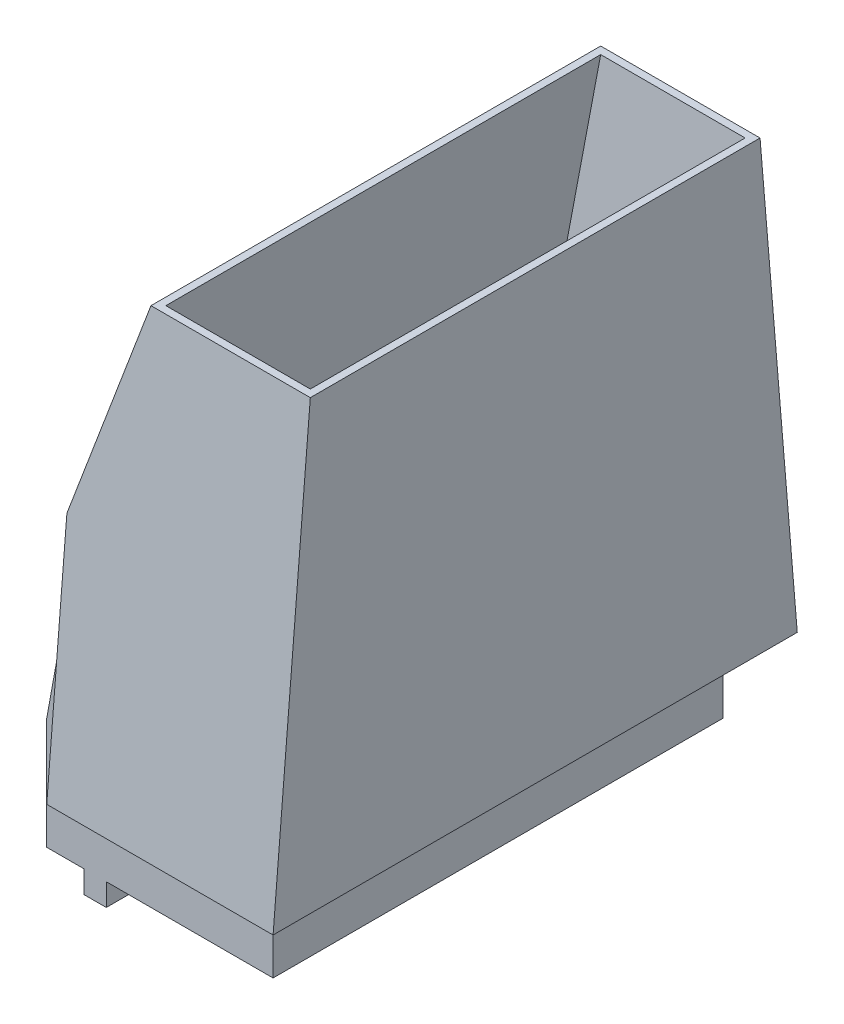
ISO-10303-21;
HEADER;
FILE_DESCRIPTION(('STEP AP214'),'2;1');
FILE_NAME('part.step','',(''),(''),'','','');
FILE_SCHEMA(('AUTOMOTIVE_DESIGN { 1 0 10303 214 1 1 1 1 }'));
ENDSEC;
DATA;
#1=APPLICATION_CONTEXT('core data for automotive mechanical design processes');
#2=APPLICATION_PROTOCOL_DEFINITION('international standard','automotive_design',2000,#1);
#3=PRODUCT_CONTEXT('',#1,'mechanical');
#4=PRODUCT('Part','Part','',(#3));
#5=PRODUCT_RELATED_PRODUCT_CATEGORY('part','',(#4));
#6=PRODUCT_DEFINITION_FORMATION('','',#4);
#7=PRODUCT_DEFINITION_CONTEXT('part definition',#1,'design');
#8=PRODUCT_DEFINITION('design','',#6,#7);
#9=PRODUCT_DEFINITION_SHAPE('','',#8);
#10=(LENGTH_UNIT() NAMED_UNIT(*) SI_UNIT(.MILLI.,.METRE.));
#11=(NAMED_UNIT(*) PLANE_ANGLE_UNIT() SI_UNIT($,.RADIAN.));
#12=(NAMED_UNIT(*) SI_UNIT($,.STERADIAN.) SOLID_ANGLE_UNIT());
#13=UNCERTAINTY_MEASURE_WITH_UNIT(LENGTH_MEASURE(1.E-05),#10,'distance_accuracy_value','');
#14=(GEOMETRIC_REPRESENTATION_CONTEXT(3) GLOBAL_UNCERTAINTY_ASSIGNED_CONTEXT((#13)) GLOBAL_UNIT_ASSIGNED_CONTEXT((#10,
#11,#12)) REPRESENTATION_CONTEXT('',''));
#15=CARTESIAN_POINT('',(0.,0.,0.));
#16=DIRECTION('',(0.,0.,1.));
#17=DIRECTION('',(1.,0.,0.));
#18=AXIS2_PLACEMENT_3D('',#15,#16,#17);
#19=CARTESIAN_POINT('',(19.,14.875,60.4));
#20=DIRECTION('',(0.,1.,0.));
#21=DIRECTION('',(0.,0.,1.));
#22=AXIS2_PLACEMENT_3D('',#19,#20,#21);
#23=PLANE('',#22);
#24=DIRECTION('',(1.,0.,0.));
#25=VECTOR('',#24,1.);
#26=CARTESIAN_POINT('',(19.,14.875,0.));
#27=LINE('',#26,#25);
#28=CARTESIAN_POINT('',(-3.4,14.875,0.));
#29=VERTEX_POINT('',#28);
#30=CARTESIAN_POINT('',(19.,14.875,0.));
#31=VERTEX_POINT('',#30);
#32=EDGE_CURVE('E212',#29,#31,#27,.T.);
#33=ORIENTED_EDGE('',*,*,#32,.T.);
#34=DIRECTION('',(0.,0.,-1.));
#35=VECTOR('',#34,1.);
#36=CARTESIAN_POINT('',(19.,14.875,60.4));
#37=LINE('',#36,#35);
#38=CARTESIAN_POINT('',(19.,14.875,60.4));
#39=VERTEX_POINT('',#38);
#40=EDGE_CURVE('E226',#39,#31,#37,.T.);
#41=ORIENTED_EDGE('',*,*,#40,.F.);
#42=DIRECTION('',(1.,0.,0.));
#43=VECTOR('',#42,1.);
#44=CARTESIAN_POINT('',(19.,14.875,60.4));
#45=LINE('',#44,#43);
#46=CARTESIAN_POINT('',(-3.4,14.875,60.4));
#47=VERTEX_POINT('',#46);
#48=EDGE_CURVE('E204',#47,#39,#45,.T.);
#49=ORIENTED_EDGE('',*,*,#48,.F.);
#50=DIRECTION('',(0.,0.,-1.));
#51=VECTOR('',#50,1.);
#52=CARTESIAN_POINT('',(-3.4,14.875,60.4));
#53=LINE('',#52,#51);
#54=CARTESIAN_POINT('',(-3.4,14.875,55.2));
#55=VERTEX_POINT('',#54);
#56=EDGE_CURVE('E313',#47,#55,#53,.T.);
#57=ORIENTED_EDGE('',*,*,#56,.T.);
#58=DIRECTION('',(1.,0.,0.));
#59=VECTOR('',#58,1.);
#60=CARTESIAN_POINT('',(-6.4,14.875,55.2));
#61=LINE('',#60,#59);
#62=CARTESIAN_POINT('',(14.,14.875,55.2));
#63=VERTEX_POINT('',#62);
#64=EDGE_CURVE('E54',#55,#63,#61,.T.);
#65=ORIENTED_EDGE('',*,*,#64,.T.);
#66=DIRECTION('',(0.,0.,-1.));
#67=VECTOR('',#66,1.);
#68=CARTESIAN_POINT('',(14.,14.875,60.4));
#69=LINE('',#68,#67);
#70=CARTESIAN_POINT('',(14.,14.875,5.2));
#71=VERTEX_POINT('',#70);
#72=EDGE_CURVE('E203',#63,#71,#69,.T.);
#73=ORIENTED_EDGE('',*,*,#72,.T.);
#74=DIRECTION('',(1.,0.,0.));
#75=VECTOR('',#74,1.);
#76=CARTESIAN_POINT('',(-6.4,14.875,5.2));
#77=LINE('',#76,#75);
#78=CARTESIAN_POINT('',(-3.4,14.875,5.2));
#79=VERTEX_POINT('',#78);
#80=EDGE_CURVE('E215',#79,#71,#77,.T.);
#81=ORIENTED_EDGE('',*,*,#80,.F.);
#82=EDGE_CURVE('E309',#79,#29,#53,.T.);
#83=ORIENTED_EDGE('',*,*,#82,.T.);
#84=EDGE_LOOP('',(#33,#41,#49,#57,#65,#73,#81,#83));
#85=FACE_BOUND('',#84,.T.);
#86=ADVANCED_FACE('F32',(#85),#23,.F.);
#87=CARTESIAN_POINT('',(19.,24.875,60.4));
#88=DIRECTION('',(-1.,0.,0.));
#89=DIRECTION('',(0.,-1.,0.));
#90=AXIS2_PLACEMENT_3D('',#87,#88,#89);
#91=PLANE('',#90);
#92=DIRECTION('',(0.,0.,-1.));
#93=VECTOR('',#92,1.);
#94=CARTESIAN_POINT('',(19.,24.875,60.4));
#95=LINE('',#94,#93);
#96=CARTESIAN_POINT('',(19.,24.875,60.4));
#97=VERTEX_POINT('',#96);
#98=CARTESIAN_POINT('',(19.,24.875,0.));
#99=VERTEX_POINT('',#98);
#100=EDGE_CURVE('E224',#97,#99,#95,.T.);
#101=ORIENTED_EDGE('',*,*,#100,.F.);
#102=DIRECTION('',(0.,-1.,0.));
#103=VECTOR('',#102,1.);
#104=CARTESIAN_POINT('',(19.,14.875,60.4));
#105=LINE('',#104,#103);
#106=EDGE_CURVE('E426',#97,#39,#105,.T.);
#107=ORIENTED_EDGE('',*,*,#106,.T.);
#108=ORIENTED_EDGE('',*,*,#40,.T.);
#109=DIRECTION('',(0.,1.,0.));
#110=VECTOR('',#109,1.);
#111=CARTESIAN_POINT('',(19.,0.,0.));
#112=LINE('',#111,#110);
#113=EDGE_CURVE('E340',#31,#99,#112,.T.);
#114=ORIENTED_EDGE('',*,*,#113,.T.);
#115=EDGE_LOOP('',(#101,#107,#108,#114));
#116=FACE_BOUND('',#115,.T.);
#117=ADVANCED_FACE('F417',(#116),#91,.F.);
#118=CARTESIAN_POINT('',(19.,24.875,60.4));
#119=DIRECTION('',(0.,1.,0.));
#120=DIRECTION('',(0.,0.,1.));
#121=AXIS2_PLACEMENT_3D('',#118,#119,#120);
#122=PLANE('',#121);
#123=DIRECTION('',(0.,0.,-1.));
#124=VECTOR('',#123,1.);
#125=CARTESIAN_POINT('',(24.,24.875,-5.));
#126=LINE('',#125,#124);
#127=CARTESIAN_POINT('',(24.,24.875,65.4));
#128=VERTEX_POINT('',#127);
#129=CARTESIAN_POINT('',(24.,24.875,-5.));
#130=VERTEX_POINT('',#129);
#131=EDGE_CURVE('E270',#128,#130,#126,.T.);
#132=ORIENTED_EDGE('',*,*,#131,.F.);
#133=DIRECTION('',(1.,0.,0.));
#134=VECTOR('',#133,1.);
#135=CARTESIAN_POINT('',(-6.4,24.875,65.4));
#136=LINE('',#135,#134);
#137=CARTESIAN_POINT('',(-6.4,24.875,65.4));
#138=VERTEX_POINT('',#137);
#139=EDGE_CURVE('E275',#138,#128,#136,.T.);
#140=ORIENTED_EDGE('',*,*,#139,.F.);
#141=DIRECTION('',(0.,0.,-1.));
#142=VECTOR('',#141,1.);
#143=CARTESIAN_POINT('',(-6.4,24.875,60.4));
#144=LINE('',#143,#142);
#145=CARTESIAN_POINT('',(-6.4,24.875,60.4));
#146=VERTEX_POINT('',#145);
#147=EDGE_CURVE('E282',#138,#146,#144,.T.);
#148=ORIENTED_EDGE('',*,*,#147,.T.);
#149=DIRECTION('',(-1.,0.,0.));
#150=VECTOR('',#149,1.);
#151=CARTESIAN_POINT('',(0.,24.875,60.4));
#152=LINE('',#151,#150);
#153=EDGE_CURVE('E236',#97,#146,#152,.T.);
#154=ORIENTED_EDGE('',*,*,#153,.F.);
#155=ORIENTED_EDGE('',*,*,#100,.T.);
#156=DIRECTION('',(-1.,0.,0.));
#157=VECTOR('',#156,1.);
#158=CARTESIAN_POINT('',(0.,24.875,0.));
#159=LINE('',#158,#157);
#160=CARTESIAN_POINT('',(-6.4,24.875,0.));
#161=VERTEX_POINT('',#160);
#162=EDGE_CURVE('E228',#99,#161,#159,.T.);
#163=ORIENTED_EDGE('',*,*,#162,.T.);
#164=DIRECTION('',(0.,0.,-1.));
#165=VECTOR('',#164,1.);
#166=CARTESIAN_POINT('',(-6.4,24.875,-5.));
#167=LINE('',#166,#165);
#168=CARTESIAN_POINT('',(-6.4,24.875,-5.));
#169=VERTEX_POINT('',#168);
#170=EDGE_CURVE('E283',#161,#169,#167,.T.);
#171=ORIENTED_EDGE('',*,*,#170,.T.);
#172=DIRECTION('',(1.,0.,0.));
#173=VECTOR('',#172,1.);
#174=CARTESIAN_POINT('',(-6.4,24.875,-5.));
#175=LINE('',#174,#173);
#176=EDGE_CURVE('E288',#169,#130,#175,.T.);
#177=ORIENTED_EDGE('',*,*,#176,.T.);
#178=EDGE_LOOP('',(#132,#140,#148,#154,#155,#163,#171,#177));
#179=FACE_BOUND('',#178,.T.);
#180=ADVANCED_FACE('F298',(#179),#122,.F.);
#181=CARTESIAN_POINT('',(24.,84.875,60.4));
#182=DIRECTION('',(-1.,0.,0.));
#183=DIRECTION('',(0.,-1.,0.));
#184=AXIS2_PLACEMENT_3D('',#181,#182,#183);
#185=PLANE('',#184);
#186=DIRECTION('',(0.,-0.99654575824488,0.0830454798537401));
#187=VECTOR('',#186,1.);
#188=CARTESIAN_POINT('',(24.,84.875,60.4));
#189=LINE('',#188,#187);
#190=CARTESIAN_POINT('',(24.,84.875,60.4));
#191=VERTEX_POINT('',#190);
#192=EDGE_CURVE('E202',#191,#128,#189,.T.);
#193=ORIENTED_EDGE('',*,*,#192,.T.);
#194=ORIENTED_EDGE('',*,*,#131,.T.);
#195=DIRECTION('',(0.,0.99654575824488,0.08304547985374));
#196=VECTOR('',#195,1.);
#197=CARTESIAN_POINT('',(24.,84.875,0.));
#198=LINE('',#197,#196);
#199=CARTESIAN_POINT('',(24.,84.875,0.));
#200=VERTEX_POINT('',#199);
#201=EDGE_CURVE('E273',#130,#200,#198,.T.);
#202=ORIENTED_EDGE('',*,*,#201,.T.);
#203=DIRECTION('',(0.,0.,-1.));
#204=VECTOR('',#203,1.);
#205=CARTESIAN_POINT('',(24.,84.875,60.4));
#206=LINE('',#205,#204);
#207=EDGE_CURVE('E222',#191,#200,#206,.T.);
#208=ORIENTED_EDGE('',*,*,#207,.F.);
#209=EDGE_LOOP('',(#193,#194,#202,#208));
#210=FACE_BOUND('',#209,.T.);
#211=ADVANCED_FACE('F305',(#210),#185,.F.);
#212=CARTESIAN_POINT('',(24.,84.875,60.4));
#213=DIRECTION('',(0.,-1.,0.));
#214=DIRECTION('',(0.,0.,-1.));
#215=AXIS2_PLACEMENT_3D('',#212,#213,#214);
#216=PLANE('',#215);
#217=DIRECTION('',(0.,0.,1.));
#218=VECTOR('',#217,1.);
#219=CARTESIAN_POINT('',(3.59999999999999,84.875,0.));
#220=LINE('',#219,#218);
#221=CARTESIAN_POINT('',(3.59999999999999,84.875,1.));
#222=VERTEX_POINT('',#221);
#223=CARTESIAN_POINT('',(3.59999999999999,84.875,59.4));
#224=VERTEX_POINT('',#223);
#225=EDGE_CURVE('E256',#222,#224,#220,.T.);
#226=ORIENTED_EDGE('',*,*,#225,.F.);
#227=DIRECTION('',(1.,0.,0.));
#228=VECTOR('',#227,1.);
#229=CARTESIAN_POINT('',(-6.40000000000001,84.875,1.));
#230=LINE('',#229,#228);
#231=CARTESIAN_POINT('',(23.,84.875,1.));
#232=VERTEX_POINT('',#231);
#233=EDGE_CURVE('E295',#222,#232,#230,.T.);
#234=ORIENTED_EDGE('',*,*,#233,.T.);
#235=DIRECTION('',(0.,0.,-1.));
#236=VECTOR('',#235,1.);
#237=CARTESIAN_POINT('',(23.,84.875,60.4));
#238=LINE('',#237,#236);
#239=CARTESIAN_POINT('',(23.,84.875,59.4));
#240=VERTEX_POINT('',#239);
#241=EDGE_CURVE('E219',#240,#232,#238,.T.);
#242=ORIENTED_EDGE('',*,*,#241,.F.);
#243=DIRECTION('',(1.,0.,0.));
#244=VECTOR('',#243,1.);
#245=CARTESIAN_POINT('',(-6.40000000000001,84.875,59.4));
#246=LINE('',#245,#244);
#247=EDGE_CURVE('E46',#224,#240,#246,.T.);
#248=ORIENTED_EDGE('',*,*,#247,.F.);
#249=EDGE_LOOP('',(#226,#234,#242,#248));
#250=FACE_BOUND('',#249,.T.);
#251=DIRECTION('',(-1.,0.,0.));
#252=VECTOR('',#251,1.);
#253=CARTESIAN_POINT('',(24.,84.875,0.));
#254=LINE('',#253,#252);
#255=CARTESIAN_POINT('',(2.59999999999999,84.875,0.));
#256=VERTEX_POINT('',#255);
#257=EDGE_CURVE('E195',#200,#256,#254,.T.);
#258=ORIENTED_EDGE('',*,*,#257,.T.);
#259=DIRECTION('',(0.,0.,-1.));
#260=VECTOR('',#259,1.);
#261=CARTESIAN_POINT('',(2.59999999999999,84.875,65.4));
#262=LINE('',#261,#260);
#263=CARTESIAN_POINT('',(2.59999999999999,84.875,60.4));
#264=VERTEX_POINT('',#263);
#265=EDGE_CURVE('E180',#264,#256,#262,.T.);
#266=ORIENTED_EDGE('',*,*,#265,.F.);
#267=DIRECTION('',(-1.,0.,0.));
#268=VECTOR('',#267,1.);
#269=CARTESIAN_POINT('',(24.,84.875,60.4));
#270=LINE('',#269,#268);
#271=EDGE_CURVE('E192',#191,#264,#270,.T.);
#272=ORIENTED_EDGE('',*,*,#271,.F.);
#273=ORIENTED_EDGE('',*,*,#207,.T.);
#274=EDGE_LOOP('',(#258,#266,#272,#273));
#275=FACE_BOUND('',#274,.T.);
#276=ADVANCED_FACE('F191',(#250,#275),#216,.F.);
#277=CARTESIAN_POINT('',(23.,84.875,60.4));
#278=DIRECTION('',(0.98687458289775,-0.161488568110541,0.));
#279=DIRECTION('',(0.161488568110541,0.98687458289775,0.));
#280=AXIS2_PLACEMENT_3D('',#277,#278,#279);
#281=PLANE('',#280);
#282=DIRECTION('',(0.,0.,-1.));
#283=VECTOR('',#282,1.);
#284=CARTESIAN_POINT('',(14.,29.875,60.4));
#285=LINE('',#284,#283);
#286=CARTESIAN_POINT('',(14.,29.875,55.2));
#287=VERTEX_POINT('',#286);
#288=CARTESIAN_POINT('',(14.,29.875,5.2));
#289=VERTEX_POINT('',#288);
#290=EDGE_CURVE('E206',#287,#289,#285,.T.);
#291=ORIENTED_EDGE('',*,*,#290,.F.);
#292=DIRECTION('',(0.161031938743097,0.984084070096704,0.0751482380801117));
#293=VECTOR('',#292,1.);
#294=CARTESIAN_POINT('',(23.0121012664712,84.9489521839905,59.4056472576865));
#295=LINE('',#294,#293);
#296=EDGE_CURVE('E241',#287,#240,#295,.T.);
#297=ORIENTED_EDGE('',*,*,#296,.T.);
#298=ORIENTED_EDGE('',*,*,#241,.T.);
#299=DIRECTION('',(-0.161031938743097,-0.984084070096704,0.0751482380801119));
#300=VECTOR('',#299,1.);
#301=CARTESIAN_POINT('',(22.2811847716126,80.482240270966,1.33544710658078));
#302=LINE('',#301,#300);
#303=EDGE_CURVE('E233',#232,#289,#302,.T.);
#304=ORIENTED_EDGE('',*,*,#303,.T.);
#305=EDGE_LOOP('',(#291,#297,#298,#304));
#306=FACE_BOUND('',#305,.T.);
#307=ADVANCED_FACE('F405',(#306),#281,.F.);
#308=CARTESIAN_POINT('',(14.,14.875,60.4));
#309=DIRECTION('',(1.,0.,0.));
#310=DIRECTION('',(0.,1.,0.));
#311=AXIS2_PLACEMENT_3D('',#308,#309,#310);
#312=PLANE('',#311);
#313=ORIENTED_EDGE('',*,*,#72,.F.);
#314=DIRECTION('',(0.,1.,0.));
#315=VECTOR('',#314,1.);
#316=CARTESIAN_POINT('',(14.,14.875,55.2));
#317=LINE('',#316,#315);
#318=EDGE_CURVE('E238',#63,#287,#317,.T.);
#319=ORIENTED_EDGE('',*,*,#318,.T.);
#320=ORIENTED_EDGE('',*,*,#290,.T.);
#321=DIRECTION('',(0.,-1.,0.));
#322=VECTOR('',#321,1.);
#323=CARTESIAN_POINT('',(14.,14.875,5.2));
#324=LINE('',#323,#322);
#325=EDGE_CURVE('E230',#289,#71,#324,.T.);
#326=ORIENTED_EDGE('',*,*,#325,.T.);
#327=EDGE_LOOP('',(#313,#319,#320,#326));
#328=FACE_BOUND('',#327,.T.);
#329=ADVANCED_FACE('F403',(#328),#312,.F.);
#330=CARTESIAN_POINT('',(0.,0.,60.4));
#331=DIRECTION('',(0.,0.,-1.));
#332=DIRECTION('',(-1.,0.,0.));
#333=AXIS2_PLACEMENT_3D('',#330,#331,#332);
#334=PLANE('',#333);
#335=ORIENTED_EDGE('',*,*,#48,.T.);
#336=ORIENTED_EDGE('',*,*,#106,.F.);
#337=ORIENTED_EDGE('',*,*,#153,.T.);
#338=DIRECTION('',(0.,-1.,0.));
#339=VECTOR('',#338,1.);
#340=CARTESIAN_POINT('',(-6.4,0.,60.4));
#341=LINE('',#340,#339);
#342=CARTESIAN_POINT('',(-6.4,57.375,60.4));
#343=VERTEX_POINT('',#342);
#344=EDGE_CURVE('E243',#343,#146,#341,.T.);
#345=ORIENTED_EDGE('',*,*,#344,.F.);
#346=DIRECTION('',(-0.178885438199983,-0.983869910099908,0.));
#347=VECTOR('',#346,1.);
#348=CARTESIAN_POINT('',(-11.4,29.875,60.4));
#349=LINE('',#348,#347);
#350=CARTESIAN_POINT('',(-11.4,29.875,60.4));
#351=VERTEX_POINT('',#350);
#352=EDGE_CURVE('E325',#343,#351,#349,.T.);
#353=ORIENTED_EDGE('',*,*,#352,.T.);
#354=DIRECTION('',(0.,-1.,0.));
#355=VECTOR('',#354,1.);
#356=CARTESIAN_POINT('',(-11.4,14.875,60.4));
#357=LINE('',#356,#355);
#358=CARTESIAN_POINT('',(-11.4,14.875,60.4));
#359=VERTEX_POINT('',#358);
#360=EDGE_CURVE('E334',#351,#359,#357,.T.);
#361=ORIENTED_EDGE('',*,*,#360,.T.);
#362=DIRECTION('',(1.,0.,0.));
#363=VECTOR('',#362,1.);
#364=CARTESIAN_POINT('',(-6.4,14.875,60.4));
#365=LINE('',#364,#363);
#366=CARTESIAN_POINT('',(-6.4,14.875,60.4));
#367=VERTEX_POINT('',#366);
#368=EDGE_CURVE('E337',#359,#367,#365,.T.);
#369=ORIENTED_EDGE('',*,*,#368,.T.);
#370=DIRECTION('',(0.,-1.,0.));
#371=VECTOR('',#370,1.);
#372=CARTESIAN_POINT('',(-6.4,11.875,60.4));
#373=LINE('',#372,#371);
#374=CARTESIAN_POINT('',(-6.4,11.875,60.4));
#375=VERTEX_POINT('',#374);
#376=EDGE_CURVE('E346',#367,#375,#373,.T.);
#377=ORIENTED_EDGE('',*,*,#376,.T.);
#378=DIRECTION('',(1.,0.,0.));
#379=VECTOR('',#378,1.);
#380=CARTESIAN_POINT('',(-3.4,11.875,60.4));
#381=LINE('',#380,#379);
#382=CARTESIAN_POINT('',(-3.4,11.875,60.4));
#383=VERTEX_POINT('',#382);
#384=EDGE_CURVE('E349',#375,#383,#381,.T.);
#385=ORIENTED_EDGE('',*,*,#384,.T.);
#386=DIRECTION('',(0.,1.,0.));
#387=VECTOR('',#386,1.);
#388=CARTESIAN_POINT('',(-3.4,14.875,60.4));
#389=LINE('',#388,#387);
#390=EDGE_CURVE('E335',#383,#47,#389,.T.);
#391=ORIENTED_EDGE('',*,*,#390,.T.);
#392=EDGE_LOOP('',(#335,#336,#337,#345,#353,#361,#369,#377,#385,#391));
#393=FACE_BOUND('',#392,.T.);
#394=ADVANCED_FACE('F323',(#393),#334,.F.);
#395=CARTESIAN_POINT('',(0.,0.,0.));
#396=DIRECTION('',(0.,0.,-1.));
#397=DIRECTION('',(-1.,0.,0.));
#398=AXIS2_PLACEMENT_3D('',#395,#396,#397);
#399=PLANE('',#398);
#400=ORIENTED_EDGE('',*,*,#113,.F.);
#401=ORIENTED_EDGE('',*,*,#32,.F.);
#402=DIRECTION('',(0.,1.,0.));
#403=VECTOR('',#402,1.);
#404=CARTESIAN_POINT('',(-3.4,14.875,0.));
#405=LINE('',#404,#403);
#406=CARTESIAN_POINT('',(-3.4,11.875,0.));
#407=VERTEX_POINT('',#406);
#408=EDGE_CURVE('E352',#407,#29,#405,.T.);
#409=ORIENTED_EDGE('',*,*,#408,.F.);
#410=DIRECTION('',(1.,0.,0.));
#411=VECTOR('',#410,1.);
#412=CARTESIAN_POINT('',(-3.4,11.875,0.));
#413=LINE('',#412,#411);
#414=CARTESIAN_POINT('',(-6.4,11.875,0.));
#415=VERTEX_POINT('',#414);
#416=EDGE_CURVE('E263',#415,#407,#413,.T.);
#417=ORIENTED_EDGE('',*,*,#416,.F.);
#418=DIRECTION('',(0.,-1.,0.));
#419=VECTOR('',#418,1.);
#420=CARTESIAN_POINT('',(-6.4,11.875,0.));
#421=LINE('',#420,#419);
#422=CARTESIAN_POINT('',(-6.4,14.875,0.));
#423=VERTEX_POINT('',#422);
#424=EDGE_CURVE('E362',#423,#415,#421,.T.);
#425=ORIENTED_EDGE('',*,*,#424,.F.);
#426=DIRECTION('',(1.,0.,0.));
#427=VECTOR('',#426,1.);
#428=CARTESIAN_POINT('',(-6.4,14.875,0.));
#429=LINE('',#428,#427);
#430=CARTESIAN_POINT('',(-11.4,14.875,0.));
#431=VERTEX_POINT('',#430);
#432=EDGE_CURVE('E359',#431,#423,#429,.T.);
#433=ORIENTED_EDGE('',*,*,#432,.F.);
#434=DIRECTION('',(0.,-1.,0.));
#435=VECTOR('',#434,1.);
#436=CARTESIAN_POINT('',(-11.4,14.875,0.));
#437=LINE('',#436,#435);
#438=CARTESIAN_POINT('',(-11.4,29.875,0.));
#439=VERTEX_POINT('',#438);
#440=EDGE_CURVE('E356',#439,#431,#437,.T.);
#441=ORIENTED_EDGE('',*,*,#440,.F.);
#442=DIRECTION('',(-0.178885438199983,-0.983869910099908,0.));
#443=VECTOR('',#442,1.);
#444=CARTESIAN_POINT('',(-11.4,29.875,0.));
#445=LINE('',#444,#443);
#446=CARTESIAN_POINT('',(-6.4,57.375,0.));
#447=VERTEX_POINT('',#446);
#448=EDGE_CURVE('E354',#447,#439,#445,.T.);
#449=ORIENTED_EDGE('',*,*,#448,.F.);
#450=DIRECTION('',(0.,1.,0.));
#451=VECTOR('',#450,1.);
#452=CARTESIAN_POINT('',(-6.4,0.,0.));
#453=LINE('',#452,#451);
#454=EDGE_CURVE('E11',#161,#447,#453,.T.);
#455=ORIENTED_EDGE('',*,*,#454,.F.);
#456=ORIENTED_EDGE('',*,*,#162,.F.);
#457=EDGE_LOOP('',(#400,#401,#409,#417,#425,#433,#441,#449,#455,#456));
#458=FACE_BOUND('',#457,.T.);
#459=ADVANCED_FACE('F387',(#458),#399,.T.);
#460=CARTESIAN_POINT('',(-6.40000000000001,84.875,1.));
#461=DIRECTION('',(0.,0.0761419517993261,0.997096987848318));
#462=DIRECTION('',(0.,-0.997096987848318,0.0761419517993261));
#463=AXIS2_PLACEMENT_3D('',#460,#461,#462);
#464=PLANE('',#463);
#465=DIRECTION('',(0.125893579297778,0.989163837339684,-0.0755361475786668));
#466=VECTOR('',#465,1.);
#467=CARTESIAN_POINT('',(3.44150806691593,83.6297062400539,1.09509515985044));
#468=LINE('',#467,#466);
#469=CARTESIAN_POINT('',(-3.4,29.875,5.2));
#470=VERTEX_POINT('',#469);
#471=EDGE_CURVE('E307',#470,#222,#468,.T.);
#472=ORIENTED_EDGE('',*,*,#471,.F.);
#473=DIRECTION('',(1.,0.,0.));
#474=VECTOR('',#473,1.);
#475=CARTESIAN_POINT('',(-6.4,29.875,5.2));
#476=LINE('',#475,#474);
#477=EDGE_CURVE('E293',#470,#289,#476,.T.);
#478=ORIENTED_EDGE('',*,*,#477,.T.);
#479=ORIENTED_EDGE('',*,*,#303,.F.);
#480=ORIENTED_EDGE('',*,*,#233,.F.);
#481=EDGE_LOOP('',(#472,#478,#479,#480));
#482=FACE_BOUND('',#481,.T.);
#483=ADVANCED_FACE('F399',(#482),#464,.T.);
#484=CARTESIAN_POINT('',(-6.4,14.875,5.2));
#485=DIRECTION('',(0.,0.,1.));
#486=DIRECTION('',(0.,-1.,0.));
#487=AXIS2_PLACEMENT_3D('',#484,#485,#486);
#488=PLANE('',#487);
#489=DIRECTION('',(0.,1.,0.));
#490=VECTOR('',#489,1.);
#491=CARTESIAN_POINT('',(-3.4,14.875,5.2));
#492=LINE('',#491,#490);
#493=EDGE_CURVE('E262',#79,#470,#492,.T.);
#494=ORIENTED_EDGE('',*,*,#493,.F.);
#495=ORIENTED_EDGE('',*,*,#80,.T.);
#496=ORIENTED_EDGE('',*,*,#325,.F.);
#497=ORIENTED_EDGE('',*,*,#477,.F.);
#498=EDGE_LOOP('',(#494,#495,#496,#497));
#499=FACE_BOUND('',#498,.T.);
#500=ADVANCED_FACE('F395',(#499),#488,.T.);
#501=CARTESIAN_POINT('',(-6.40000000000001,84.875,0.));
#502=DIRECTION('',(0.,0.08304547985374,-0.996545758244879));
#503=DIRECTION('',(0.,0.99654575824488,0.08304547985374));
#504=AXIS2_PLACEMENT_3D('',#501,#502,#503);
#505=PLANE('',#504);
#506=DIRECTION('',(-0.310068113674053,-0.947430347337385,-0.0789525289447821));
#507=VECTOR('',#506,1.);
#508=CARTESIAN_POINT('',(1.73471988394352,82.2310885342719,-0.220325955477342));
#509=LINE('',#508,#507);
#510=CARTESIAN_POINT('',(-6.4,57.375,-2.29166666666666));
#511=VERTEX_POINT('',#510);
#512=EDGE_CURVE('E187',#256,#511,#509,.T.);
#513=ORIENTED_EDGE('',*,*,#512,.F.);
#514=ORIENTED_EDGE('',*,*,#257,.F.);
#515=ORIENTED_EDGE('',*,*,#201,.F.);
#516=ORIENTED_EDGE('',*,*,#176,.F.);
#517=DIRECTION('',(0.,0.99654575824488,0.08304547985374));
#518=VECTOR('',#517,1.);
#519=CARTESIAN_POINT('',(-6.40000000000001,84.875,0.));
#520=LINE('',#519,#518);
#521=EDGE_CURVE('E286',#169,#511,#520,.T.);
#522=ORIENTED_EDGE('',*,*,#521,.T.);
#523=EDGE_LOOP('',(#513,#514,#515,#516,#522));
#524=FACE_BOUND('',#523,.T.);
#525=ADVANCED_FACE('F303',(#524),#505,.T.);
#526=CARTESIAN_POINT('',(-6.4,0.,0.));
#527=DIRECTION('',(1.,0.,0.));
#528=DIRECTION('',(0.,0.,-1.));
#529=AXIS2_PLACEMENT_3D('',#526,#527,#528);
#530=PLANE('',#529);
#531=ORIENTED_EDGE('',*,*,#454,.T.);
#532=DIRECTION('',(0.,0.,-1.));
#533=VECTOR('',#532,1.);
#534=CARTESIAN_POINT('',(-6.4,57.375,65.4));
#535=LINE('',#534,#533);
#536=EDGE_CURVE('E196',#447,#511,#535,.T.);
#537=ORIENTED_EDGE('',*,*,#536,.T.);
#538=ORIENTED_EDGE('',*,*,#521,.F.);
#539=ORIENTED_EDGE('',*,*,#170,.F.);
#540=EDGE_LOOP('',(#531,#537,#538,#539));
#541=FACE_BOUND('',#540,.T.);
#542=ADVANCED_FACE('F432',(#541),#530,.F.);
#543=CARTESIAN_POINT('',(-6.40000000000001,84.875,59.4));
#544=DIRECTION('',(0.,0.0761419517993259,-0.997096987848318));
#545=DIRECTION('',(0.,0.997096987848318,0.0761419517993259));
#546=AXIS2_PLACEMENT_3D('',#543,#544,#545);
#547=PLANE('',#546);
#548=DIRECTION('',(-0.125893579297778,-0.989163837339684,-0.0755361475786666));
#549=VECTOR('',#548,1.);
#550=CARTESIAN_POINT('',(3.44150806691593,83.6297062400539,59.3049048401496));
#551=LINE('',#550,#549);
#552=CARTESIAN_POINT('',(-3.4,29.875,55.2));
#553=VERTEX_POINT('',#552);
#554=EDGE_CURVE('E39',#224,#553,#551,.T.);
#555=ORIENTED_EDGE('',*,*,#554,.F.);
#556=ORIENTED_EDGE('',*,*,#247,.T.);
#557=ORIENTED_EDGE('',*,*,#296,.F.);
#558=DIRECTION('',(1.,0.,0.));
#559=VECTOR('',#558,1.);
#560=CARTESIAN_POINT('',(-6.4,29.875,55.2));
#561=LINE('',#560,#559);
#562=EDGE_CURVE('E268',#553,#287,#561,.T.);
#563=ORIENTED_EDGE('',*,*,#562,.F.);
#564=EDGE_LOOP('',(#555,#556,#557,#563));
#565=FACE_BOUND('',#564,.T.);
#566=ADVANCED_FACE('F269',(#565),#547,.T.);
#567=CARTESIAN_POINT('',(-6.4,29.875,55.2));
#568=DIRECTION('',(0.,0.,-1.));
#569=DIRECTION('',(0.,1.,0.));
#570=AXIS2_PLACEMENT_3D('',#567,#568,#569);
#571=PLANE('',#570);
#572=DIRECTION('',(0.,-1.,0.));
#573=VECTOR('',#572,1.);
#574=CARTESIAN_POINT('',(-3.4,29.875,55.2));
#575=LINE('',#574,#573);
#576=EDGE_CURVE('E248',#553,#55,#575,.T.);
#577=ORIENTED_EDGE('',*,*,#576,.F.);
#578=ORIENTED_EDGE('',*,*,#562,.T.);
#579=ORIENTED_EDGE('',*,*,#318,.F.);
#580=ORIENTED_EDGE('',*,*,#64,.F.);
#581=EDGE_LOOP('',(#577,#578,#579,#580));
#582=FACE_BOUND('',#581,.T.);
#583=ADVANCED_FACE('F266',(#582),#571,.T.);
#584=CARTESIAN_POINT('',(-6.40000000000001,84.875,60.4));
#585=DIRECTION('',(0.,0.08304547985374,0.99654575824488));
#586=DIRECTION('',(0.,-0.99654575824488,0.0830454798537401));
#587=AXIS2_PLACEMENT_3D('',#584,#585,#586);
#588=PLANE('',#587);
#589=DIRECTION('',(0.310068113674053,0.947430347337385,-0.0789525289447822));
#590=VECTOR('',#589,1.);
#591=CARTESIAN_POINT('',(1.73471988394352,82.2310885342719,60.6203259554773));
#592=LINE('',#591,#590);
#593=CARTESIAN_POINT('',(-6.4,57.375,62.6916666666667));
#594=VERTEX_POINT('',#593);
#595=EDGE_CURVE('E177',#594,#264,#592,.T.);
#596=ORIENTED_EDGE('',*,*,#595,.F.);
#597=DIRECTION('',(0.,-0.99654575824488,0.0830454798537401));
#598=VECTOR('',#597,1.);
#599=CARTESIAN_POINT('',(-6.40000000000001,84.875,60.4));
#600=LINE('',#599,#598);
#601=EDGE_CURVE('E306',#594,#138,#600,.T.);
#602=ORIENTED_EDGE('',*,*,#601,.T.);
#603=ORIENTED_EDGE('',*,*,#139,.T.);
#604=ORIENTED_EDGE('',*,*,#192,.F.);
#605=ORIENTED_EDGE('',*,*,#271,.T.);
#606=EDGE_LOOP('',(#596,#602,#603,#604,#605));
#607=FACE_BOUND('',#606,.T.);
#608=ADVANCED_FACE('F199',(#607),#588,.T.);
#609=CARTESIAN_POINT('',(-6.4,0.,0.));
#610=DIRECTION('',(-1.,0.,0.));
#611=DIRECTION('',(0.,-1.,0.));
#612=AXIS2_PLACEMENT_3D('',#609,#610,#611);
#613=PLANE('',#612);
#614=EDGE_CURVE('E183',#594,#343,#535,.T.);
#615=ORIENTED_EDGE('',*,*,#614,.T.);
#616=ORIENTED_EDGE('',*,*,#344,.T.);
#617=ORIENTED_EDGE('',*,*,#147,.F.);
#618=ORIENTED_EDGE('',*,*,#601,.F.);
#619=EDGE_LOOP('',(#615,#616,#617,#618));
#620=FACE_BOUND('',#619,.T.);
#621=ADVANCED_FACE('F319',(#620),#613,.T.);
#622=CARTESIAN_POINT('',(-3.4,29.875,0.));
#623=DIRECTION('',(1.,0.,0.));
#624=DIRECTION('',(0.,1.,0.));
#625=AXIS2_PLACEMENT_3D('',#622,#623,#624);
#626=PLANE('',#625);
#627=ORIENTED_EDGE('',*,*,#82,.F.);
#628=ORIENTED_EDGE('',*,*,#493,.T.);
#629=DIRECTION('',(0.,0.,1.));
#630=VECTOR('',#629,1.);
#631=CARTESIAN_POINT('',(-3.4,29.875,0.));
#632=LINE('',#631,#630);
#633=EDGE_CURVE('E253',#470,#553,#632,.T.);
#634=ORIENTED_EDGE('',*,*,#633,.T.);
#635=ORIENTED_EDGE('',*,*,#576,.T.);
#636=ORIENTED_EDGE('',*,*,#56,.F.);
#637=ORIENTED_EDGE('',*,*,#390,.F.);
#638=DIRECTION('',(0.,0.,1.));
#639=VECTOR('',#638,1.);
#640=CARTESIAN_POINT('',(-3.4,11.875,0.));
#641=LINE('',#640,#639);
#642=EDGE_CURVE('E367',#407,#383,#641,.T.);
#643=ORIENTED_EDGE('',*,*,#642,.F.);
#644=ORIENTED_EDGE('',*,*,#408,.T.);
#645=EDGE_LOOP('',(#627,#628,#634,#635,#636,#637,#643,#644));
#646=FACE_BOUND('',#645,.T.);
#647=ADVANCED_FACE('F260',(#646),#626,.T.);
#648=CARTESIAN_POINT('',(-3.4,11.875,0.));
#649=DIRECTION('',(0.,-1.,0.));
#650=DIRECTION('',(0.,0.,-1.));
#651=AXIS2_PLACEMENT_3D('',#648,#649,#650);
#652=PLANE('',#651);
#653=ORIENTED_EDGE('',*,*,#642,.T.);
#654=ORIENTED_EDGE('',*,*,#384,.F.);
#655=DIRECTION('',(0.,0.,1.));
#656=VECTOR('',#655,1.);
#657=CARTESIAN_POINT('',(-6.4,11.875,0.));
#658=LINE('',#657,#656);
#659=EDGE_CURVE('E369',#415,#375,#658,.T.);
#660=ORIENTED_EDGE('',*,*,#659,.F.);
#661=ORIENTED_EDGE('',*,*,#416,.T.);
#662=EDGE_LOOP('',(#653,#654,#660,#661));
#663=FACE_BOUND('',#662,.T.);
#664=ADVANCED_FACE('F381',(#663),#652,.T.);
#665=CARTESIAN_POINT('',(-6.4,11.875,0.));
#666=DIRECTION('',(-1.,0.,0.));
#667=DIRECTION('',(0.,0.,1.));
#668=AXIS2_PLACEMENT_3D('',#665,#666,#667);
#669=PLANE('',#668);
#670=ORIENTED_EDGE('',*,*,#659,.T.);
#671=ORIENTED_EDGE('',*,*,#376,.F.);
#672=DIRECTION('',(0.,0.,1.));
#673=VECTOR('',#672,1.);
#674=CARTESIAN_POINT('',(-6.4,14.875,0.));
#675=LINE('',#674,#673);
#676=EDGE_CURVE('E371',#423,#367,#675,.T.);
#677=ORIENTED_EDGE('',*,*,#676,.F.);
#678=ORIENTED_EDGE('',*,*,#424,.T.);
#679=EDGE_LOOP('',(#670,#671,#677,#678));
#680=FACE_BOUND('',#679,.T.);
#681=ADVANCED_FACE('F443',(#680),#669,.T.);
#682=CARTESIAN_POINT('',(-6.4,14.875,0.));
#683=DIRECTION('',(0.,-1.,0.));
#684=DIRECTION('',(0.,0.,-1.));
#685=AXIS2_PLACEMENT_3D('',#682,#683,#684);
#686=PLANE('',#685);
#687=ORIENTED_EDGE('',*,*,#676,.T.);
#688=ORIENTED_EDGE('',*,*,#368,.F.);
#689=DIRECTION('',(0.,0.,1.));
#690=VECTOR('',#689,1.);
#691=CARTESIAN_POINT('',(-11.4,14.875,0.));
#692=LINE('',#691,#690);
#693=EDGE_CURVE('E373',#431,#359,#692,.T.);
#694=ORIENTED_EDGE('',*,*,#693,.F.);
#695=ORIENTED_EDGE('',*,*,#432,.T.);
#696=EDGE_LOOP('',(#687,#688,#694,#695));
#697=FACE_BOUND('',#696,.T.);
#698=ADVANCED_FACE('F441',(#697),#686,.T.);
#699=CARTESIAN_POINT('',(-11.4,14.875,0.));
#700=DIRECTION('',(-1.,0.,0.));
#701=DIRECTION('',(0.,-1.,0.));
#702=AXIS2_PLACEMENT_3D('',#699,#700,#701);
#703=PLANE('',#702);
#704=ORIENTED_EDGE('',*,*,#693,.T.);
#705=ORIENTED_EDGE('',*,*,#360,.F.);
#706=DIRECTION('',(0.,0.,1.));
#707=VECTOR('',#706,1.);
#708=CARTESIAN_POINT('',(-11.4,29.875,0.));
#709=LINE('',#708,#707);
#710=EDGE_CURVE('E332',#439,#351,#709,.T.);
#711=ORIENTED_EDGE('',*,*,#710,.F.);
#712=ORIENTED_EDGE('',*,*,#440,.T.);
#713=EDGE_LOOP('',(#704,#705,#711,#712));
#714=FACE_BOUND('',#713,.T.);
#715=ADVANCED_FACE('F438',(#714),#703,.T.);
#716=CARTESIAN_POINT('',(-11.4,29.875,0.));
#717=DIRECTION('',(-0.983869910099908,0.178885438199983,0.));
#718=DIRECTION('',(-0.178885438199983,-0.983869910099908,0.));
#719=AXIS2_PLACEMENT_3D('',#716,#717,#718);
#720=PLANE('',#719);
#721=DIRECTION('',(0.,0.,-1.));
#722=VECTOR('',#721,1.);
#723=CARTESIAN_POINT('',(-6.40000000000001,57.375,0.));
#724=LINE('',#723,#722);
#725=EDGE_CURVE('E246',#343,#447,#724,.T.);
#726=ORIENTED_EDGE('',*,*,#725,.T.);
#727=ORIENTED_EDGE('',*,*,#448,.T.);
#728=ORIENTED_EDGE('',*,*,#710,.T.);
#729=ORIENTED_EDGE('',*,*,#352,.F.);
#730=EDGE_LOOP('',(#726,#727,#728,#729));
#731=FACE_BOUND('',#730,.T.);
#732=ADVANCED_FACE('F329',(#731),#720,.T.);
#733=CARTESIAN_POINT('',(-3.4,29.875,0.));
#734=DIRECTION('',(0.991997911723619,-0.126254279673915,0.));
#735=DIRECTION('',(0.126254279673915,0.991997911723619,0.));
#736=AXIS2_PLACEMENT_3D('',#733,#734,#735);
#737=PLANE('',#736);
#738=ORIENTED_EDGE('',*,*,#633,.F.);
#739=ORIENTED_EDGE('',*,*,#471,.T.);
#740=ORIENTED_EDGE('',*,*,#225,.T.);
#741=ORIENTED_EDGE('',*,*,#554,.T.);
#742=EDGE_LOOP('',(#738,#739,#740,#741));
#743=FACE_BOUND('',#742,.T.);
#744=ADVANCED_FACE('F252',(#743),#737,.T.);
#745=CARTESIAN_POINT('',(-6.4,57.375,65.4));
#746=DIRECTION('',(0.950397129044689,-0.311039060414625,0.));
#747=DIRECTION('',(0.311039060414625,0.950397129044689,0.));
#748=AXIS2_PLACEMENT_3D('',#745,#746,#747);
#749=PLANE('',#748);
#750=ORIENTED_EDGE('',*,*,#512,.T.);
#751=ORIENTED_EDGE('',*,*,#536,.F.);
#752=ORIENTED_EDGE('',*,*,#725,.F.);
#753=ORIENTED_EDGE('',*,*,#614,.F.);
#754=ORIENTED_EDGE('',*,*,#595,.T.);
#755=ORIENTED_EDGE('',*,*,#265,.T.);
#756=EDGE_LOOP('',(#750,#751,#752,#753,#754,#755));
#757=FACE_BOUND('',#756,.T.);
#758=ADVANCED_FACE('F179',(#757),#749,.F.);
#759=CLOSED_SHELL('',(#86,#117,#180,#211,#276,#307,#329,#394,#459,#483,#500,#525,#542,#566,#583,
#608,#621,#647,#664,#681,#698,#715,#732,#744,#758));
#760=MANIFOLD_SOLID_BREP('B2',#759);
#761=ADVANCED_BREP_SHAPE_REPRESENTATION('',(#18,#760),#14);
#762=SHAPE_DEFINITION_REPRESENTATION(#9,#761);
ENDSEC;
END-ISO-10303-21;
